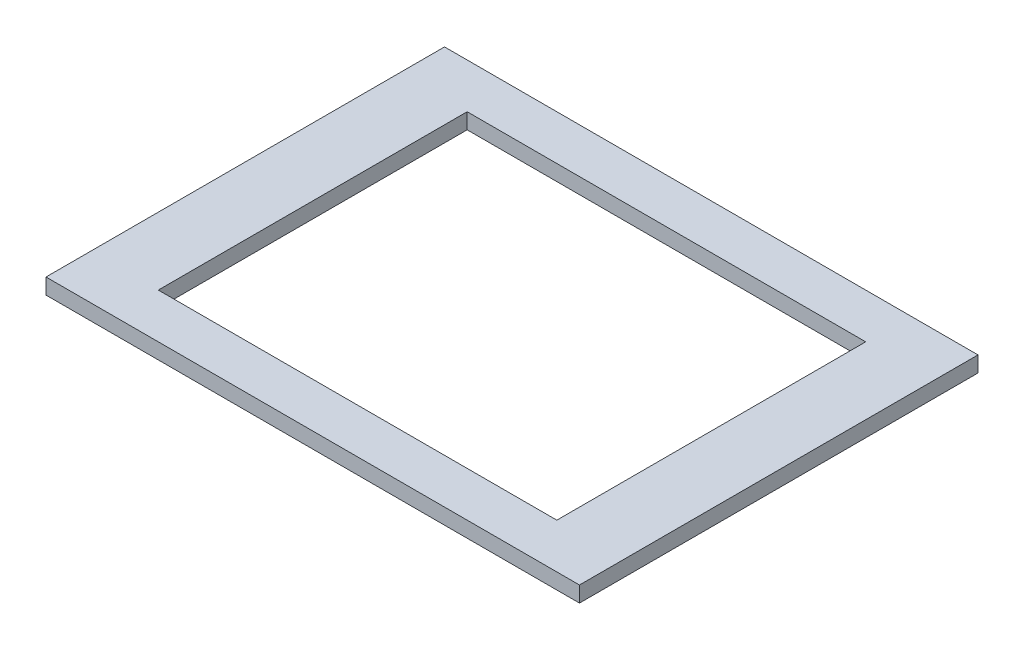
ISO-10303-21;
HEADER;
FILE_DESCRIPTION(('STEP AP214'),'2;1');
FILE_NAME('part.step','',(''),(''),'','','');
FILE_SCHEMA(('AUTOMOTIVE_DESIGN { 1 0 10303 214 1 1 1 1 }'));
ENDSEC;
DATA;
#1=APPLICATION_CONTEXT('core data for automotive mechanical design processes');
#2=APPLICATION_PROTOCOL_DEFINITION('international standard','automotive_design',2000,#1);
#3=PRODUCT_CONTEXT('',#1,'mechanical');
#4=PRODUCT('Part','Part','',(#3));
#5=PRODUCT_RELATED_PRODUCT_CATEGORY('part','',(#4));
#6=PRODUCT_DEFINITION_FORMATION('','',#4);
#7=PRODUCT_DEFINITION_CONTEXT('part definition',#1,'design');
#8=PRODUCT_DEFINITION('design','',#6,#7);
#9=PRODUCT_DEFINITION_SHAPE('','',#8);
#10=(LENGTH_UNIT() NAMED_UNIT(*) SI_UNIT(.MILLI.,.METRE.));
#11=(NAMED_UNIT(*) PLANE_ANGLE_UNIT() SI_UNIT($,.RADIAN.));
#12=(NAMED_UNIT(*) SI_UNIT($,.STERADIAN.) SOLID_ANGLE_UNIT());
#13=UNCERTAINTY_MEASURE_WITH_UNIT(LENGTH_MEASURE(1.E-05),#10,'distance_accuracy_value','');
#14=(GEOMETRIC_REPRESENTATION_CONTEXT(3) GLOBAL_UNCERTAINTY_ASSIGNED_CONTEXT((#13)) GLOBAL_UNIT_ASSIGNED_CONTEXT((#10,
#11,#12)) REPRESENTATION_CONTEXT('',''));
#15=CARTESIAN_POINT('',(0.,0.,0.));
#16=DIRECTION('',(0.,0.,1.));
#17=DIRECTION('',(1.,0.,0.));
#18=AXIS2_PLACEMENT_3D('',#15,#16,#17);
#19=CARTESIAN_POINT('',(-170.,5.,127.));
#20=DIRECTION('',(1.,0.,0.));
#21=DIRECTION('',(0.,0.,-1.));
#22=AXIS2_PLACEMENT_3D('',#19,#20,#21);
#23=PLANE('',#22);
#24=DIRECTION('',(0.,0.,1.));
#25=VECTOR('',#24,1.);
#26=CARTESIAN_POINT('',(-170.,-5.,127.));
#27=LINE('',#26,#25);
#28=CARTESIAN_POINT('',(-170.,-5.,-127.));
#29=VERTEX_POINT('',#28);
#30=CARTESIAN_POINT('',(-170.,-5.,127.));
#31=VERTEX_POINT('',#30);
#32=EDGE_CURVE('E120',#29,#31,#27,.T.);
#33=ORIENTED_EDGE('',*,*,#32,.T.);
#34=DIRECTION('',(0.,-1.,0.));
#35=VECTOR('',#34,1.);
#36=CARTESIAN_POINT('',(-170.,5.,127.));
#37=LINE('',#36,#35);
#38=CARTESIAN_POINT('',(-170.,5.,127.));
#39=VERTEX_POINT('',#38);
#40=EDGE_CURVE('E11',#39,#31,#37,.T.);
#41=ORIENTED_EDGE('',*,*,#40,.F.);
#42=DIRECTION('',(0.,0.,1.));
#43=VECTOR('',#42,1.);
#44=CARTESIAN_POINT('',(-170.,5.,127.));
#45=LINE('',#44,#43);
#46=CARTESIAN_POINT('',(-170.,5.,-127.));
#47=VERTEX_POINT('',#46);
#48=EDGE_CURVE('E139',#47,#39,#45,.T.);
#49=ORIENTED_EDGE('',*,*,#48,.F.);
#50=DIRECTION('',(0.,-1.,0.));
#51=VECTOR('',#50,1.);
#52=CARTESIAN_POINT('',(-170.,5.,-127.));
#53=LINE('',#52,#51);
#54=EDGE_CURVE('E147',#47,#29,#53,.T.);
#55=ORIENTED_EDGE('',*,*,#54,.T.);
#56=EDGE_LOOP('',(#33,#41,#49,#55));
#57=FACE_BOUND('',#56,.T.);
#58=ADVANCED_FACE('F39',(#57),#23,.F.);
#59=CARTESIAN_POINT('',(170.,5.,127.));
#60=DIRECTION('',(0.,0.,-1.));
#61=DIRECTION('',(-1.,0.,0.));
#62=AXIS2_PLACEMENT_3D('',#59,#60,#61);
#63=PLANE('',#62);
#64=DIRECTION('',(1.,0.,0.));
#65=VECTOR('',#64,1.);
#66=CARTESIAN_POINT('',(170.,-5.,127.));
#67=LINE('',#66,#65);
#68=CARTESIAN_POINT('',(170.,-5.,127.));
#69=VERTEX_POINT('',#68);
#70=EDGE_CURVE('E153',#31,#69,#67,.T.);
#71=ORIENTED_EDGE('',*,*,#70,.T.);
#72=DIRECTION('',(0.,-1.,0.));
#73=VECTOR('',#72,1.);
#74=CARTESIAN_POINT('',(170.,5.,127.));
#75=LINE('',#74,#73);
#76=CARTESIAN_POINT('',(170.,5.,127.));
#77=VERTEX_POINT('',#76);
#78=EDGE_CURVE('E46',#77,#69,#75,.T.);
#79=ORIENTED_EDGE('',*,*,#78,.F.);
#80=DIRECTION('',(1.,0.,0.));
#81=VECTOR('',#80,1.);
#82=CARTESIAN_POINT('',(170.,5.,127.));
#83=LINE('',#82,#81);
#84=EDGE_CURVE('E141',#39,#77,#83,.T.);
#85=ORIENTED_EDGE('',*,*,#84,.F.);
#86=ORIENTED_EDGE('',*,*,#40,.T.);
#87=EDGE_LOOP('',(#71,#79,#85,#86));
#88=FACE_BOUND('',#87,.T.);
#89=ADVANCED_FACE('F182',(#88),#63,.F.);
#90=CARTESIAN_POINT('',(170.,5.,127.));
#91=DIRECTION('',(-1.,0.,0.));
#92=DIRECTION('',(0.,0.,1.));
#93=AXIS2_PLACEMENT_3D('',#90,#91,#92);
#94=PLANE('',#93);
#95=DIRECTION('',(0.,0.,-1.));
#96=VECTOR('',#95,1.);
#97=CARTESIAN_POINT('',(170.,-5.,127.));
#98=LINE('',#97,#96);
#99=CARTESIAN_POINT('',(170.,-5.,-127.));
#100=VERTEX_POINT('',#99);
#101=EDGE_CURVE('E154',#69,#100,#98,.T.);
#102=ORIENTED_EDGE('',*,*,#101,.T.);
#103=DIRECTION('',(0.,-1.,0.));
#104=VECTOR('',#103,1.);
#105=CARTESIAN_POINT('',(170.,5.,-127.));
#106=LINE('',#105,#104);
#107=CARTESIAN_POINT('',(170.,5.,-127.));
#108=VERTEX_POINT('',#107);
#109=EDGE_CURVE('E159',#108,#100,#106,.T.);
#110=ORIENTED_EDGE('',*,*,#109,.F.);
#111=DIRECTION('',(0.,0.,-1.));
#112=VECTOR('',#111,1.);
#113=CARTESIAN_POINT('',(170.,5.,127.));
#114=LINE('',#113,#112);
#115=EDGE_CURVE('E148',#77,#108,#114,.T.);
#116=ORIENTED_EDGE('',*,*,#115,.F.);
#117=ORIENTED_EDGE('',*,*,#78,.T.);
#118=EDGE_LOOP('',(#102,#110,#116,#117));
#119=FACE_BOUND('',#118,.T.);
#120=ADVANCED_FACE('F170',(#119),#94,.F.);
#121=CARTESIAN_POINT('',(170.,5.,-127.));
#122=DIRECTION('',(0.,0.,1.));
#123=DIRECTION('',(1.,0.,0.));
#124=AXIS2_PLACEMENT_3D('',#121,#122,#123);
#125=PLANE('',#124);
#126=DIRECTION('',(-1.,0.,0.));
#127=VECTOR('',#126,1.);
#128=CARTESIAN_POINT('',(170.,-5.,-127.));
#129=LINE('',#128,#127);
#130=EDGE_CURVE('E145',#100,#29,#129,.T.);
#131=ORIENTED_EDGE('',*,*,#130,.T.);
#132=ORIENTED_EDGE('',*,*,#54,.F.);
#133=DIRECTION('',(-1.,0.,0.));
#134=VECTOR('',#133,1.);
#135=CARTESIAN_POINT('',(170.,5.,-127.));
#136=LINE('',#135,#134);
#137=EDGE_CURVE('E146',#108,#47,#136,.T.);
#138=ORIENTED_EDGE('',*,*,#137,.F.);
#139=ORIENTED_EDGE('',*,*,#109,.T.);
#140=EDGE_LOOP('',(#131,#132,#138,#139));
#141=FACE_BOUND('',#140,.T.);
#142=ADVANCED_FACE('F171',(#141),#125,.F.);
#143=CARTESIAN_POINT('',(0.,5.,0.));
#144=DIRECTION('',(0.,1.,0.));
#145=DIRECTION('',(0.,0.,1.));
#146=AXIS2_PLACEMENT_3D('',#143,#144,#145);
#147=PLANE('',#146);
#148=DIRECTION('',(0.,0.,1.));
#149=VECTOR('',#148,1.);
#150=CARTESIAN_POINT('',(-127.,5.,98.4250000000001));
#151=LINE('',#150,#149);
#152=CARTESIAN_POINT('',(-127.,5.,-98.425));
#153=VERTEX_POINT('',#152);
#154=CARTESIAN_POINT('',(-127.,5.,98.4250000000001));
#155=VERTEX_POINT('',#154);
#156=EDGE_CURVE('E52',#153,#155,#151,.T.);
#157=ORIENTED_EDGE('',*,*,#156,.F.);
#158=DIRECTION('',(-1.,0.,0.));
#159=VECTOR('',#158,1.);
#160=CARTESIAN_POINT('',(127.,5.,-98.425));
#161=LINE('',#160,#159);
#162=CARTESIAN_POINT('',(127.,5.,-98.425));
#163=VERTEX_POINT('',#162);
#164=EDGE_CURVE('E112',#163,#153,#161,.T.);
#165=ORIENTED_EDGE('',*,*,#164,.F.);
#166=DIRECTION('',(0.,0.,-1.));
#167=VECTOR('',#166,1.);
#168=CARTESIAN_POINT('',(127.,5.,98.425));
#169=LINE('',#168,#167);
#170=CARTESIAN_POINT('',(127.,5.,98.425));
#171=VERTEX_POINT('',#170);
#172=EDGE_CURVE('E132',#171,#163,#169,.T.);
#173=ORIENTED_EDGE('',*,*,#172,.F.);
#174=DIRECTION('',(1.,0.,0.));
#175=VECTOR('',#174,1.);
#176=CARTESIAN_POINT('',(127.,5.,98.425));
#177=LINE('',#176,#175);
#178=EDGE_CURVE('E124',#155,#171,#177,.T.);
#179=ORIENTED_EDGE('',*,*,#178,.F.);
#180=EDGE_LOOP('',(#157,#165,#173,#179));
#181=FACE_BOUND('',#180,.T.);
#182=ORIENTED_EDGE('',*,*,#48,.T.);
#183=ORIENTED_EDGE('',*,*,#84,.T.);
#184=ORIENTED_EDGE('',*,*,#115,.T.);
#185=ORIENTED_EDGE('',*,*,#137,.T.);
#186=EDGE_LOOP('',(#182,#183,#184,#185));
#187=FACE_BOUND('',#186,.T.);
#188=ADVANCED_FACE('F179',(#181,#187),#147,.T.);
#189=CARTESIAN_POINT('',(0.,-5.,0.));
#190=DIRECTION('',(0.,1.,0.));
#191=DIRECTION('',(0.,0.,1.));
#192=AXIS2_PLACEMENT_3D('',#189,#190,#191);
#193=PLANE('',#192);
#194=DIRECTION('',(1.,0.,0.));
#195=VECTOR('',#194,1.);
#196=CARTESIAN_POINT('',(127.,-5.,-98.425));
#197=LINE('',#196,#195);
#198=CARTESIAN_POINT('',(-127.,-5.,-98.425));
#199=VERTEX_POINT('',#198);
#200=CARTESIAN_POINT('',(127.,-5.,-98.425));
#201=VERTEX_POINT('',#200);
#202=EDGE_CURVE('E122',#199,#201,#197,.T.);
#203=ORIENTED_EDGE('',*,*,#202,.F.);
#204=DIRECTION('',(0.,0.,-1.));
#205=VECTOR('',#204,1.);
#206=CARTESIAN_POINT('',(-127.,-5.,98.4250000000001));
#207=LINE('',#206,#205);
#208=CARTESIAN_POINT('',(-127.,-5.,98.4250000000001));
#209=VERTEX_POINT('',#208);
#210=EDGE_CURVE('E104',#209,#199,#207,.T.);
#211=ORIENTED_EDGE('',*,*,#210,.F.);
#212=DIRECTION('',(-1.,0.,0.));
#213=VECTOR('',#212,1.);
#214=CARTESIAN_POINT('',(127.,-5.,98.425));
#215=LINE('',#214,#213);
#216=CARTESIAN_POINT('',(127.,-5.,98.425));
#217=VERTEX_POINT('',#216);
#218=EDGE_CURVE('E111',#217,#209,#215,.T.);
#219=ORIENTED_EDGE('',*,*,#218,.F.);
#220=DIRECTION('',(0.,0.,1.));
#221=VECTOR('',#220,1.);
#222=CARTESIAN_POINT('',(127.,-5.,98.425));
#223=LINE('',#222,#221);
#224=EDGE_CURVE('E62',#201,#217,#223,.T.);
#225=ORIENTED_EDGE('',*,*,#224,.F.);
#226=EDGE_LOOP('',(#203,#211,#219,#225));
#227=FACE_BOUND('',#226,.T.);
#228=ORIENTED_EDGE('',*,*,#32,.F.);
#229=ORIENTED_EDGE('',*,*,#130,.F.);
#230=ORIENTED_EDGE('',*,*,#101,.F.);
#231=ORIENTED_EDGE('',*,*,#70,.F.);
#232=EDGE_LOOP('',(#228,#229,#230,#231));
#233=FACE_BOUND('',#232,.T.);
#234=ADVANCED_FACE('F118',(#227,#233),#193,.F.);
#235=CARTESIAN_POINT('',(-127.,-5.001,98.4250000000001));
#236=DIRECTION('',(-1.,0.,0.));
#237=DIRECTION('',(0.,0.,1.));
#238=AXIS2_PLACEMENT_3D('',#235,#236,#237);
#239=PLANE('',#238);
#240=ORIENTED_EDGE('',*,*,#210,.T.);
#241=DIRECTION('',(0.,1.,0.));
#242=VECTOR('',#241,1.);
#243=CARTESIAN_POINT('',(-127.,-5.001,-98.425));
#244=LINE('',#243,#242);
#245=EDGE_CURVE('E119',#199,#153,#244,.T.);
#246=ORIENTED_EDGE('',*,*,#245,.T.);
#247=ORIENTED_EDGE('',*,*,#156,.T.);
#248=DIRECTION('',(0.,1.,0.));
#249=VECTOR('',#248,1.);
#250=CARTESIAN_POINT('',(-127.,-5.001,98.4250000000001));
#251=LINE('',#250,#249);
#252=EDGE_CURVE('E101',#209,#155,#251,.T.);
#253=ORIENTED_EDGE('',*,*,#252,.F.);
#254=EDGE_LOOP('',(#240,#246,#247,#253));
#255=FACE_BOUND('',#254,.T.);
#256=ADVANCED_FACE('F103',(#255),#239,.F.);
#257=CARTESIAN_POINT('',(127.,-5.001,-98.425));
#258=DIRECTION('',(0.,0.,-1.));
#259=DIRECTION('',(-1.,0.,0.));
#260=AXIS2_PLACEMENT_3D('',#257,#258,#259);
#261=PLANE('',#260);
#262=ORIENTED_EDGE('',*,*,#202,.T.);
#263=DIRECTION('',(0.,1.,0.));
#264=VECTOR('',#263,1.);
#265=CARTESIAN_POINT('',(127.,-5.001,-98.425));
#266=LINE('',#265,#264);
#267=EDGE_CURVE('E140',#201,#163,#266,.T.);
#268=ORIENTED_EDGE('',*,*,#267,.T.);
#269=ORIENTED_EDGE('',*,*,#164,.T.);
#270=ORIENTED_EDGE('',*,*,#245,.F.);
#271=EDGE_LOOP('',(#262,#268,#269,#270));
#272=FACE_BOUND('',#271,.T.);
#273=ADVANCED_FACE('F196',(#272),#261,.F.);
#274=CARTESIAN_POINT('',(127.,-5.001,98.425));
#275=DIRECTION('',(1.,0.,0.));
#276=DIRECTION('',(0.,0.,-1.));
#277=AXIS2_PLACEMENT_3D('',#274,#275,#276);
#278=PLANE('',#277);
#279=ORIENTED_EDGE('',*,*,#224,.T.);
#280=DIRECTION('',(0.,1.,0.));
#281=VECTOR('',#280,1.);
#282=CARTESIAN_POINT('',(127.,-5.001,98.425));
#283=LINE('',#282,#281);
#284=EDGE_CURVE('E109',#217,#171,#283,.T.);
#285=ORIENTED_EDGE('',*,*,#284,.T.);
#286=ORIENTED_EDGE('',*,*,#172,.T.);
#287=ORIENTED_EDGE('',*,*,#267,.F.);
#288=EDGE_LOOP('',(#279,#285,#286,#287));
#289=FACE_BOUND('',#288,.T.);
#290=ADVANCED_FACE('F203',(#289),#278,.F.);
#291=CARTESIAN_POINT('',(127.,-5.001,98.425));
#292=DIRECTION('',(0.,0.,1.));
#293=DIRECTION('',(1.,0.,0.));
#294=AXIS2_PLACEMENT_3D('',#291,#292,#293);
#295=PLANE('',#294);
#296=ORIENTED_EDGE('',*,*,#218,.T.);
#297=ORIENTED_EDGE('',*,*,#252,.T.);
#298=ORIENTED_EDGE('',*,*,#178,.T.);
#299=ORIENTED_EDGE('',*,*,#284,.F.);
#300=EDGE_LOOP('',(#296,#297,#298,#299));
#301=FACE_BOUND('',#300,.T.);
#302=ADVANCED_FACE('F113',(#301),#295,.F.);
#303=CLOSED_SHELL('',(#58,#89,#120,#142,#188,#234,#256,#273,#290,#302));
#304=MANIFOLD_SOLID_BREP('B2',#303);
#305=ADVANCED_BREP_SHAPE_REPRESENTATION('',(#18,#304),#14);
#306=SHAPE_DEFINITION_REPRESENTATION(#9,#305);
ENDSEC;
END-ISO-10303-21;
